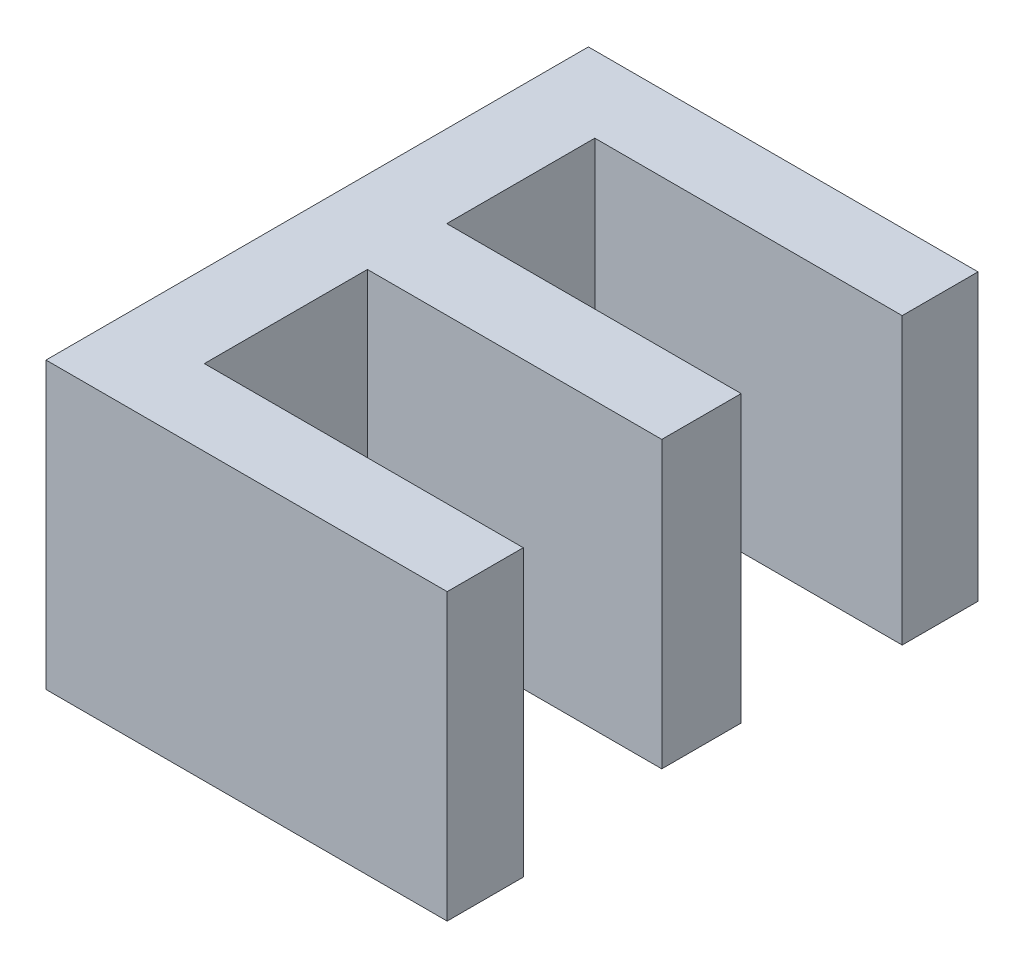
ISO-10303-21;
HEADER;
FILE_DESCRIPTION(('STEP AP214'),'2;1');
FILE_NAME('part.step','',(''),(''),'','','');
FILE_SCHEMA(('AUTOMOTIVE_DESIGN { 1 0 10303 214 1 1 1 1 }'));
ENDSEC;
DATA;
#1=APPLICATION_CONTEXT('core data for automotive mechanical design processes');
#2=APPLICATION_PROTOCOL_DEFINITION('international standard','automotive_design',2000,#1);
#3=PRODUCT_CONTEXT('',#1,'mechanical');
#4=PRODUCT('Part','Part','',(#3));
#5=PRODUCT_RELATED_PRODUCT_CATEGORY('part','',(#4));
#6=PRODUCT_DEFINITION_FORMATION('','',#4);
#7=PRODUCT_DEFINITION_CONTEXT('part definition',#1,'design');
#8=PRODUCT_DEFINITION('design','',#6,#7);
#9=PRODUCT_DEFINITION_SHAPE('','',#8);
#10=(LENGTH_UNIT() NAMED_UNIT(*) SI_UNIT(.MILLI.,.METRE.));
#11=(NAMED_UNIT(*) PLANE_ANGLE_UNIT() SI_UNIT($,.RADIAN.));
#12=(NAMED_UNIT(*) SI_UNIT($,.STERADIAN.) SOLID_ANGLE_UNIT());
#13=UNCERTAINTY_MEASURE_WITH_UNIT(LENGTH_MEASURE(1.E-05),#10,'distance_accuracy_value','');
#14=(GEOMETRIC_REPRESENTATION_CONTEXT(3) GLOBAL_UNCERTAINTY_ASSIGNED_CONTEXT((#13)) GLOBAL_UNIT_ASSIGNED_CONTEXT((#10,
#11,#12)) REPRESENTATION_CONTEXT('',''));
#15=CARTESIAN_POINT('',(0.,0.,0.));
#16=DIRECTION('',(0.,0.,1.));
#17=DIRECTION('',(1.,0.,0.));
#18=AXIS2_PLACEMENT_3D('',#15,#16,#17);
#19=CARTESIAN_POINT('',(189.428720172753,10.,-58.9556493619376));
#20=DIRECTION('',(-1.,0.,0.));
#21=DIRECTION('',(0.,0.,1.));
#22=AXIS2_PLACEMENT_3D('',#19,#20,#21);
#23=PLANE('',#22);
#24=DIRECTION('',(0.,0.,-1.));
#25=VECTOR('',#24,1.);
#26=CARTESIAN_POINT('',(189.428720172753,0.,-58.9556493619376));
#27=LINE('',#26,#25);
#28=CARTESIAN_POINT('',(189.428720172753,0.,-56.28859622837));
#29=VERTEX_POINT('',#28);
#30=CARTESIAN_POINT('',(189.428720172753,0.,-58.9556493619376));
#31=VERTEX_POINT('',#30);
#32=EDGE_CURVE('E150',#29,#31,#27,.T.);
#33=ORIENTED_EDGE('',*,*,#32,.T.);
#34=DIRECTION('',(0.,-1.,0.));
#35=VECTOR('',#34,1.);
#36=CARTESIAN_POINT('',(189.428720172753,10.,-58.9556493619376));
#37=LINE('',#36,#35);
#38=CARTESIAN_POINT('',(189.428720172753,10.,-58.9556493619376));
#39=VERTEX_POINT('',#38);
#40=EDGE_CURVE('E11',#39,#31,#37,.T.);
#41=ORIENTED_EDGE('',*,*,#40,.F.);
#42=DIRECTION('',(0.,0.,-1.));
#43=VECTOR('',#42,1.);
#44=CARTESIAN_POINT('',(189.428720172753,10.,-58.9556493619376));
#45=LINE('',#44,#43);
#46=CARTESIAN_POINT('',(189.428720172753,10.,-56.28859622837));
#47=VERTEX_POINT('',#46);
#48=EDGE_CURVE('E172',#47,#39,#45,.T.);
#49=ORIENTED_EDGE('',*,*,#48,.F.);
#50=DIRECTION('',(0.,-1.,0.));
#51=VECTOR('',#50,1.);
#52=CARTESIAN_POINT('',(189.428720172753,10.,-56.28859622837));
#53=LINE('',#52,#51);
#54=EDGE_CURVE('E146',#47,#29,#53,.T.);
#55=ORIENTED_EDGE('',*,*,#54,.T.);
#56=EDGE_LOOP('',(#33,#41,#49,#55));
#57=FACE_BOUND('',#56,.T.);
#58=ADVANCED_FACE('F30',(#57),#23,.F.);
#59=CARTESIAN_POINT('',(178.251792209026,10.,-58.9556493619376));
#60=DIRECTION('',(0.,0.,1.));
#61=DIRECTION('',(1.,0.,0.));
#62=AXIS2_PLACEMENT_3D('',#59,#60,#61);
#63=PLANE('',#62);
#64=DIRECTION('',(-1.,0.,0.));
#65=VECTOR('',#64,1.);
#66=CARTESIAN_POINT('',(178.251792209026,0.,-58.9556493619376));
#67=LINE('',#66,#65);
#68=CARTESIAN_POINT('',(178.251792209026,0.,-58.9556493619376));
#69=VERTEX_POINT('',#68);
#70=EDGE_CURVE('E153',#31,#69,#67,.T.);
#71=ORIENTED_EDGE('',*,*,#70,.T.);
#72=DIRECTION('',(0.,-1.,0.));
#73=VECTOR('',#72,1.);
#74=CARTESIAN_POINT('',(178.251792209026,10.,-58.9556493619376));
#75=LINE('',#74,#73);
#76=CARTESIAN_POINT('',(178.251792209026,10.,-58.9556493619376));
#77=VERTEX_POINT('',#76);
#78=EDGE_CURVE('E38',#77,#69,#75,.T.);
#79=ORIENTED_EDGE('',*,*,#78,.F.);
#80=DIRECTION('',(-1.,0.,0.));
#81=VECTOR('',#80,1.);
#82=CARTESIAN_POINT('',(178.251792209026,10.,-58.9556493619376));
#83=LINE('',#82,#81);
#84=EDGE_CURVE('E101',#39,#77,#83,.T.);
#85=ORIENTED_EDGE('',*,*,#84,.F.);
#86=ORIENTED_EDGE('',*,*,#40,.T.);
#87=EDGE_LOOP('',(#71,#79,#85,#86));
#88=FACE_BOUND('',#87,.T.);
#89=ADVANCED_FACE('F250',(#88),#63,.F.);
#90=CARTESIAN_POINT('',(178.251792209026,10.,-64.6705491804947));
#91=DIRECTION('',(-1.,0.,0.));
#92=DIRECTION('',(0.,0.,1.));
#93=AXIS2_PLACEMENT_3D('',#90,#91,#92);
#94=PLANE('',#93);
#95=DIRECTION('',(0.,0.,-1.));
#96=VECTOR('',#95,1.);
#97=CARTESIAN_POINT('',(178.251792209026,0.,-64.6705491804947));
#98=LINE('',#97,#96);
#99=CARTESIAN_POINT('',(178.251792209026,0.,-64.6705491804947));
#100=VERTEX_POINT('',#99);
#101=EDGE_CURVE('E155',#69,#100,#98,.T.);
#102=ORIENTED_EDGE('',*,*,#101,.T.);
#103=DIRECTION('',(0.,-1.,0.));
#104=VECTOR('',#103,1.);
#105=CARTESIAN_POINT('',(178.251792209026,10.,-64.6705491804947));
#106=LINE('',#105,#104);
#107=CARTESIAN_POINT('',(178.251792209026,10.,-64.6705491804947));
#108=VERTEX_POINT('',#107);
#109=EDGE_CURVE('E191',#108,#100,#106,.T.);
#110=ORIENTED_EDGE('',*,*,#109,.F.);
#111=DIRECTION('',(0.,0.,-1.));
#112=VECTOR('',#111,1.);
#113=CARTESIAN_POINT('',(178.251792209026,10.,-64.6705491804947));
#114=LINE('',#113,#112);
#115=EDGE_CURVE('E199',#77,#108,#114,.T.);
#116=ORIENTED_EDGE('',*,*,#115,.F.);
#117=ORIENTED_EDGE('',*,*,#78,.T.);
#118=EDGE_LOOP('',(#102,#110,#116,#117));
#119=FACE_BOUND('',#118,.T.);
#120=ADVANCED_FACE('F197',(#119),#94,.F.);
#121=CARTESIAN_POINT('',(188.568956483235,10.,-64.6705491804947));
#122=DIRECTION('',(0.,0.,-1.));
#123=DIRECTION('',(-1.,0.,0.));
#124=AXIS2_PLACEMENT_3D('',#121,#122,#123);
#125=PLANE('',#124);
#126=DIRECTION('',(1.,0.,0.));
#127=VECTOR('',#126,1.);
#128=CARTESIAN_POINT('',(188.568956483235,0.,-64.6705491804947));
#129=LINE('',#128,#127);
#130=CARTESIAN_POINT('',(188.568956483235,0.,-64.6705491804947));
#131=VERTEX_POINT('',#130);
#132=EDGE_CURVE('E157',#100,#131,#129,.T.);
#133=ORIENTED_EDGE('',*,*,#132,.T.);
#134=DIRECTION('',(0.,-1.,0.));
#135=VECTOR('',#134,1.);
#136=CARTESIAN_POINT('',(188.568956483235,10.,-64.6705491804947));
#137=LINE('',#136,#135);
#138=CARTESIAN_POINT('',(188.568956483235,10.,-64.6705491804947));
#139=VERTEX_POINT('',#138);
#140=EDGE_CURVE('E188',#139,#131,#137,.T.);
#141=ORIENTED_EDGE('',*,*,#140,.F.);
#142=DIRECTION('',(1.,0.,0.));
#143=VECTOR('',#142,1.);
#144=CARTESIAN_POINT('',(188.568956483235,10.,-64.6705491804947));
#145=LINE('',#144,#143);
#146=EDGE_CURVE('E217',#108,#139,#145,.T.);
#147=ORIENTED_EDGE('',*,*,#146,.F.);
#148=ORIENTED_EDGE('',*,*,#109,.T.);
#149=EDGE_LOOP('',(#133,#141,#147,#148));
#150=FACE_BOUND('',#149,.T.);
#151=ADVANCED_FACE('F208',(#150),#125,.F.);
#152=CARTESIAN_POINT('',(188.568956483235,10.,-67.452137587757));
#153=DIRECTION('',(-1.,0.,0.));
#154=DIRECTION('',(0.,0.,1.));
#155=AXIS2_PLACEMENT_3D('',#152,#153,#154);
#156=PLANE('',#155);
#157=DIRECTION('',(0.,0.,-1.));
#158=VECTOR('',#157,1.);
#159=CARTESIAN_POINT('',(188.568956483235,0.,-67.452137587757));
#160=LINE('',#159,#158);
#161=CARTESIAN_POINT('',(188.568956483235,0.,-67.452137587757));
#162=VERTEX_POINT('',#161);
#163=EDGE_CURVE('E159',#131,#162,#160,.T.);
#164=ORIENTED_EDGE('',*,*,#163,.T.);
#165=DIRECTION('',(0.,-1.,0.));
#166=VECTOR('',#165,1.);
#167=CARTESIAN_POINT('',(188.568956483235,10.,-67.452137587757));
#168=LINE('',#167,#166);
#169=CARTESIAN_POINT('',(188.568956483235,10.,-67.452137587757));
#170=VERTEX_POINT('',#169);
#171=EDGE_CURVE('E185',#170,#162,#168,.T.);
#172=ORIENTED_EDGE('',*,*,#171,.F.);
#173=DIRECTION('',(0.,0.,-1.));
#174=VECTOR('',#173,1.);
#175=CARTESIAN_POINT('',(188.568956483235,10.,-67.452137587757));
#176=LINE('',#175,#174);
#177=EDGE_CURVE('E214',#139,#170,#176,.T.);
#178=ORIENTED_EDGE('',*,*,#177,.F.);
#179=ORIENTED_EDGE('',*,*,#140,.T.);
#180=EDGE_LOOP('',(#164,#172,#178,#179));
#181=FACE_BOUND('',#180,.T.);
#182=ADVANCED_FACE('F212',(#181),#156,.F.);
#183=CARTESIAN_POINT('',(178.251792209026,10.,-67.452137587757));
#184=DIRECTION('',(0.,0.,1.));
#185=DIRECTION('',(1.,0.,0.));
#186=AXIS2_PLACEMENT_3D('',#183,#184,#185);
#187=PLANE('',#186);
#188=DIRECTION('',(-1.,0.,0.));
#189=VECTOR('',#188,1.);
#190=CARTESIAN_POINT('',(178.251792209026,0.,-67.452137587757));
#191=LINE('',#190,#189);
#192=CARTESIAN_POINT('',(178.251792209026,0.,-67.452137587757));
#193=VERTEX_POINT('',#192);
#194=EDGE_CURVE('E161',#162,#193,#191,.T.);
#195=ORIENTED_EDGE('',*,*,#194,.T.);
#196=DIRECTION('',(0.,-1.,0.));
#197=VECTOR('',#196,1.);
#198=CARTESIAN_POINT('',(178.251792209026,10.,-67.452137587757));
#199=LINE('',#198,#197);
#200=CARTESIAN_POINT('',(178.251792209026,10.,-67.452137587757));
#201=VERTEX_POINT('',#200);
#202=EDGE_CURVE('E182',#201,#193,#199,.T.);
#203=ORIENTED_EDGE('',*,*,#202,.F.);
#204=DIRECTION('',(-1.,0.,0.));
#205=VECTOR('',#204,1.);
#206=CARTESIAN_POINT('',(178.251792209026,10.,-67.452137587757));
#207=LINE('',#206,#205);
#208=EDGE_CURVE('E216',#170,#201,#207,.T.);
#209=ORIENTED_EDGE('',*,*,#208,.F.);
#210=ORIENTED_EDGE('',*,*,#171,.T.);
#211=EDGE_LOOP('',(#195,#203,#209,#210));
#212=FACE_BOUND('',#211,.T.);
#213=ADVANCED_FACE('F263',(#212),#187,.F.);
#214=CARTESIAN_POINT('',(178.251792209026,10.,-72.6404550002934));
#215=DIRECTION('',(-1.,0.,0.));
#216=DIRECTION('',(0.,0.,1.));
#217=AXIS2_PLACEMENT_3D('',#214,#215,#216);
#218=PLANE('',#217);
#219=DIRECTION('',(0.,0.,-1.));
#220=VECTOR('',#219,1.);
#221=CARTESIAN_POINT('',(178.251792209026,0.,-72.6404550002934));
#222=LINE('',#221,#220);
#223=CARTESIAN_POINT('',(178.251792209026,0.,-72.6404550002934));
#224=VERTEX_POINT('',#223);
#225=EDGE_CURVE('E163',#193,#224,#222,.T.);
#226=ORIENTED_EDGE('',*,*,#225,.T.);
#227=DIRECTION('',(0.,-1.,0.));
#228=VECTOR('',#227,1.);
#229=CARTESIAN_POINT('',(178.251792209026,10.,-72.6404550002934));
#230=LINE('',#229,#228);
#231=CARTESIAN_POINT('',(178.251792209026,10.,-72.6404550002934));
#232=VERTEX_POINT('',#231);
#233=EDGE_CURVE('E179',#232,#224,#230,.T.);
#234=ORIENTED_EDGE('',*,*,#233,.F.);
#235=DIRECTION('',(0.,0.,-1.));
#236=VECTOR('',#235,1.);
#237=CARTESIAN_POINT('',(178.251792209026,10.,-72.6404550002934));
#238=LINE('',#237,#236);
#239=EDGE_CURVE('E219',#201,#232,#238,.T.);
#240=ORIENTED_EDGE('',*,*,#239,.F.);
#241=ORIENTED_EDGE('',*,*,#202,.T.);
#242=EDGE_LOOP('',(#226,#234,#240,#241));
#243=FACE_BOUND('',#242,.T.);
#244=ADVANCED_FACE('F266',(#243),#218,.F.);
#245=CARTESIAN_POINT('',(189.024125495333,10.,-72.6404550002934));
#246=DIRECTION('',(0.,0.,-1.));
#247=DIRECTION('',(-1.,0.,0.));
#248=AXIS2_PLACEMENT_3D('',#245,#246,#247);
#249=PLANE('',#248);
#250=DIRECTION('',(1.,0.,0.));
#251=VECTOR('',#250,1.);
#252=CARTESIAN_POINT('',(189.024125495333,0.,-72.6404550002934));
#253=LINE('',#252,#251);
#254=CARTESIAN_POINT('',(189.024125495333,0.,-72.6404550002934));
#255=VERTEX_POINT('',#254);
#256=EDGE_CURVE('E165',#224,#255,#253,.T.);
#257=ORIENTED_EDGE('',*,*,#256,.T.);
#258=DIRECTION('',(0.,-1.,0.));
#259=VECTOR('',#258,1.);
#260=CARTESIAN_POINT('',(189.024125495333,10.,-72.6404550002934));
#261=LINE('',#260,#259);
#262=CARTESIAN_POINT('',(189.024125495333,10.,-72.6404550002934));
#263=VERTEX_POINT('',#262);
#264=EDGE_CURVE('E176',#263,#255,#261,.T.);
#265=ORIENTED_EDGE('',*,*,#264,.F.);
#266=DIRECTION('',(1.,0.,0.));
#267=VECTOR('',#266,1.);
#268=CARTESIAN_POINT('',(189.024125495333,10.,-72.6404550002934));
#269=LINE('',#268,#267);
#270=EDGE_CURVE('E225',#232,#263,#269,.T.);
#271=ORIENTED_EDGE('',*,*,#270,.F.);
#272=ORIENTED_EDGE('',*,*,#233,.T.);
#273=EDGE_LOOP('',(#257,#265,#271,#272));
#274=FACE_BOUND('',#273,.T.);
#275=ADVANCED_FACE('F231',(#274),#249,.F.);
#276=CARTESIAN_POINT('',(189.024125495333,10.,-75.2974570796293));
#277=DIRECTION('',(-1.,0.,0.));
#278=DIRECTION('',(0.,0.,1.));
#279=AXIS2_PLACEMENT_3D('',#276,#277,#278);
#280=PLANE('',#279);
#281=DIRECTION('',(0.,0.,-1.));
#282=VECTOR('',#281,1.);
#283=CARTESIAN_POINT('',(189.024125495333,0.,-75.2974570796293));
#284=LINE('',#283,#282);
#285=CARTESIAN_POINT('',(189.024125495333,0.,-75.2974570796293));
#286=VERTEX_POINT('',#285);
#287=EDGE_CURVE('E167',#255,#286,#284,.T.);
#288=ORIENTED_EDGE('',*,*,#287,.T.);
#289=DIRECTION('',(0.,-1.,0.));
#290=VECTOR('',#289,1.);
#291=CARTESIAN_POINT('',(189.024125495333,10.,-75.2974570796293));
#292=LINE('',#291,#290);
#293=CARTESIAN_POINT('',(189.024125495333,10.,-75.2974570796293));
#294=VERTEX_POINT('',#293);
#295=EDGE_CURVE('E141',#294,#286,#292,.T.);
#296=ORIENTED_EDGE('',*,*,#295,.F.);
#297=DIRECTION('',(0.,0.,-1.));
#298=VECTOR('',#297,1.);
#299=CARTESIAN_POINT('',(189.024125495333,10.,-75.2974570796293));
#300=LINE('',#299,#298);
#301=EDGE_CURVE('E132',#263,#294,#300,.T.);
#302=ORIENTED_EDGE('',*,*,#301,.F.);
#303=ORIENTED_EDGE('',*,*,#264,.T.);
#304=EDGE_LOOP('',(#288,#296,#302,#303));
#305=FACE_BOUND('',#304,.T.);
#306=ADVANCED_FACE('F235',(#305),#280,.F.);
#307=CARTESIAN_POINT('',(175.369055132409,10.,-75.2974570796293));
#308=DIRECTION('',(0.,0.,1.));
#309=DIRECTION('',(1.,0.,0.));
#310=AXIS2_PLACEMENT_3D('',#307,#308,#309);
#311=PLANE('',#310);
#312=DIRECTION('',(-1.,0.,0.));
#313=VECTOR('',#312,1.);
#314=CARTESIAN_POINT('',(175.369055132409,0.,-75.2974570796293));
#315=LINE('',#314,#313);
#316=CARTESIAN_POINT('',(175.369055132409,0.,-75.2974570796293));
#317=VERTEX_POINT('',#316);
#318=EDGE_CURVE('E140',#286,#317,#315,.T.);
#319=ORIENTED_EDGE('',*,*,#318,.T.);
#320=DIRECTION('',(0.,-1.,0.));
#321=VECTOR('',#320,1.);
#322=CARTESIAN_POINT('',(175.369055132409,10.,-75.2974570796293));
#323=LINE('',#322,#321);
#324=CARTESIAN_POINT('',(175.369055132409,10.,-75.2974570796293));
#325=VERTEX_POINT('',#324);
#326=EDGE_CURVE('E137',#325,#317,#323,.T.);
#327=ORIENTED_EDGE('',*,*,#326,.F.);
#328=DIRECTION('',(-1.,0.,0.));
#329=VECTOR('',#328,1.);
#330=CARTESIAN_POINT('',(175.369055132409,10.,-75.2974570796293));
#331=LINE('',#330,#329);
#332=EDGE_CURVE('E126',#294,#325,#331,.T.);
#333=ORIENTED_EDGE('',*,*,#332,.F.);
#334=ORIENTED_EDGE('',*,*,#295,.T.);
#335=EDGE_LOOP('',(#319,#327,#333,#334));
#336=FACE_BOUND('',#335,.T.);
#337=ADVANCED_FACE('F138',(#336),#311,.F.);
#338=CARTESIAN_POINT('',(175.369055132409,10.,-56.28859622837));
#339=DIRECTION('',(1.,0.,0.));
#340=DIRECTION('',(0.,0.,-1.));
#341=AXIS2_PLACEMENT_3D('',#338,#339,#340);
#342=PLANE('',#341);
#343=DIRECTION('',(0.,0.,1.));
#344=VECTOR('',#343,1.);
#345=CARTESIAN_POINT('',(175.369055132409,0.,-56.28859622837));
#346=LINE('',#345,#344);
#347=CARTESIAN_POINT('',(175.369055132409,0.,-56.28859622837));
#348=VERTEX_POINT('',#347);
#349=EDGE_CURVE('E87',#317,#348,#346,.T.);
#350=ORIENTED_EDGE('',*,*,#349,.T.);
#351=DIRECTION('',(0.,-1.,0.));
#352=VECTOR('',#351,1.);
#353=CARTESIAN_POINT('',(175.369055132409,10.,-56.28859622837));
#354=LINE('',#353,#352);
#355=CARTESIAN_POINT('',(175.369055132409,10.,-56.28859622837));
#356=VERTEX_POINT('',#355);
#357=EDGE_CURVE('E142',#356,#348,#354,.T.);
#358=ORIENTED_EDGE('',*,*,#357,.F.);
#359=DIRECTION('',(0.,0.,1.));
#360=VECTOR('',#359,1.);
#361=CARTESIAN_POINT('',(175.369055132409,10.,-56.28859622837));
#362=LINE('',#361,#360);
#363=EDGE_CURVE('E130',#325,#356,#362,.T.);
#364=ORIENTED_EDGE('',*,*,#363,.F.);
#365=ORIENTED_EDGE('',*,*,#326,.T.);
#366=EDGE_LOOP('',(#350,#358,#364,#365));
#367=FACE_BOUND('',#366,.T.);
#368=ADVANCED_FACE('F144',(#367),#342,.F.);
#369=CARTESIAN_POINT('',(189.428720172753,10.,-56.28859622837));
#370=DIRECTION('',(0.,0.,-1.));
#371=DIRECTION('',(-1.,0.,0.));
#372=AXIS2_PLACEMENT_3D('',#369,#370,#371);
#373=PLANE('',#372);
#374=DIRECTION('',(1.,0.,0.));
#375=VECTOR('',#374,1.);
#376=CARTESIAN_POINT('',(189.428720172753,0.,-56.28859622837));
#377=LINE('',#376,#375);
#378=EDGE_CURVE('E93',#348,#29,#377,.T.);
#379=ORIENTED_EDGE('',*,*,#378,.T.);
#380=ORIENTED_EDGE('',*,*,#54,.F.);
#381=DIRECTION('',(1.,0.,0.));
#382=VECTOR('',#381,1.);
#383=CARTESIAN_POINT('',(189.428720172753,10.,-56.28859622837));
#384=LINE('',#383,#382);
#385=EDGE_CURVE('E46',#356,#47,#384,.T.);
#386=ORIENTED_EDGE('',*,*,#385,.F.);
#387=ORIENTED_EDGE('',*,*,#357,.T.);
#388=EDGE_LOOP('',(#379,#380,#386,#387));
#389=FACE_BOUND('',#388,.T.);
#390=ADVANCED_FACE('F239',(#389),#373,.F.);
#391=CARTESIAN_POINT('',(0.,10.,0.));
#392=DIRECTION('',(0.,-1.,0.));
#393=DIRECTION('',(0.,0.,-1.));
#394=AXIS2_PLACEMENT_3D('',#391,#392,#393);
#395=PLANE('',#394);
#396=ORIENTED_EDGE('',*,*,#48,.T.);
#397=ORIENTED_EDGE('',*,*,#84,.T.);
#398=ORIENTED_EDGE('',*,*,#115,.T.);
#399=ORIENTED_EDGE('',*,*,#146,.T.);
#400=ORIENTED_EDGE('',*,*,#177,.T.);
#401=ORIENTED_EDGE('',*,*,#208,.T.);
#402=ORIENTED_EDGE('',*,*,#239,.T.);
#403=ORIENTED_EDGE('',*,*,#270,.T.);
#404=ORIENTED_EDGE('',*,*,#301,.T.);
#405=ORIENTED_EDGE('',*,*,#332,.T.);
#406=ORIENTED_EDGE('',*,*,#363,.T.);
#407=ORIENTED_EDGE('',*,*,#385,.T.);
#408=EDGE_LOOP('',(#396,#397,#398,#399,#400,#401,#402,#403,#404,#405,#406,#407));
#409=FACE_BOUND('',#408,.T.);
#410=ADVANCED_FACE('F128',(#409),#395,.F.);
#411=CARTESIAN_POINT('',(0.,0.,0.));
#412=DIRECTION('',(0.,-1.,0.));
#413=DIRECTION('',(0.,0.,-1.));
#414=AXIS2_PLACEMENT_3D('',#411,#412,#413);
#415=PLANE('',#414);
#416=ORIENTED_EDGE('',*,*,#32,.F.);
#417=ORIENTED_EDGE('',*,*,#378,.F.);
#418=ORIENTED_EDGE('',*,*,#349,.F.);
#419=ORIENTED_EDGE('',*,*,#318,.F.);
#420=ORIENTED_EDGE('',*,*,#287,.F.);
#421=ORIENTED_EDGE('',*,*,#256,.F.);
#422=ORIENTED_EDGE('',*,*,#225,.F.);
#423=ORIENTED_EDGE('',*,*,#194,.F.);
#424=ORIENTED_EDGE('',*,*,#163,.F.);
#425=ORIENTED_EDGE('',*,*,#132,.F.);
#426=ORIENTED_EDGE('',*,*,#101,.F.);
#427=ORIENTED_EDGE('',*,*,#70,.F.);
#428=EDGE_LOOP('',(#416,#417,#418,#419,#420,#421,#422,#423,#424,#425,#426,#427));
#429=FACE_BOUND('',#428,.T.);
#430=ADVANCED_FACE('F203',(#429),#415,.T.);
#431=CLOSED_SHELL('',(#58,#89,#120,#151,#182,#213,#244,#275,#306,#337,#368,#390,#410,#430));
#432=MANIFOLD_SOLID_BREP('B2',#431);
#433=ADVANCED_BREP_SHAPE_REPRESENTATION('',(#18,#432),#14);
#434=SHAPE_DEFINITION_REPRESENTATION(#9,#433);
ENDSEC;
END-ISO-10303-21;
